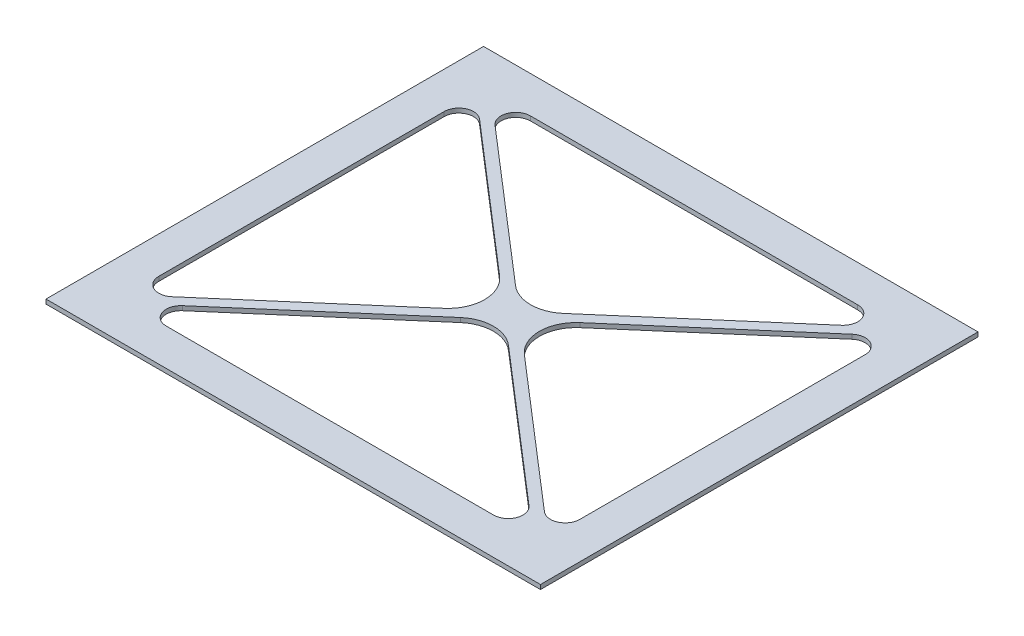
ISO-10303-21;
HEADER;
FILE_DESCRIPTION(('STEP AP214'),'2;1');
FILE_NAME('part.step','',(''),(''),'','','');
FILE_SCHEMA(('AUTOMOTIVE_DESIGN { 1 0 10303 214 1 1 1 1 }'));
ENDSEC;
DATA;
#1=APPLICATION_CONTEXT('core data for automotive mechanical design processes');
#2=APPLICATION_PROTOCOL_DEFINITION('international standard','automotive_design',2000,#1);
#3=PRODUCT_CONTEXT('',#1,'mechanical');
#4=PRODUCT('Part','Part','',(#3));
#5=PRODUCT_RELATED_PRODUCT_CATEGORY('part','',(#4));
#6=PRODUCT_DEFINITION_FORMATION('','',#4);
#7=PRODUCT_DEFINITION_CONTEXT('part definition',#1,'design');
#8=PRODUCT_DEFINITION('design','',#6,#7);
#9=PRODUCT_DEFINITION_SHAPE('','',#8);
#10=(LENGTH_UNIT() NAMED_UNIT(*) SI_UNIT(.MILLI.,.METRE.));
#11=(NAMED_UNIT(*) PLANE_ANGLE_UNIT() SI_UNIT($,.RADIAN.));
#12=(NAMED_UNIT(*) SI_UNIT($,.STERADIAN.) SOLID_ANGLE_UNIT());
#13=UNCERTAINTY_MEASURE_WITH_UNIT(LENGTH_MEASURE(1.E-05),#10,'distance_accuracy_value','');
#14=(GEOMETRIC_REPRESENTATION_CONTEXT(3) GLOBAL_UNCERTAINTY_ASSIGNED_CONTEXT((#13)) GLOBAL_UNIT_ASSIGNED_CONTEXT((#10,
#11,#12)) REPRESENTATION_CONTEXT('',''));
#15=CARTESIAN_POINT('',(0.,0.,0.));
#16=DIRECTION('',(0.,0.,1.));
#17=DIRECTION('',(1.,0.,0.));
#18=AXIS2_PLACEMENT_3D('',#15,#16,#17);
#19=CARTESIAN_POINT('',(0.,1.2,0.));
#20=DIRECTION('',(0.,-1.,0.));
#21=DIRECTION('',(0.,0.,-1.));
#22=AXIS2_PLACEMENT_3D('',#19,#20,#21);
#23=PLANE('',#22);
#24=DIRECTION('',(-0.757260981413012,0.,-0.653112399231098));
#25=VECTOR('',#24,1.);
#26=CARTESIAN_POINT('',(122.7,1.2,-10.));
#27=LINE('',#26,#25);
#28=CARTESIAN_POINT('',(114.550069440113,1.2,-17.029043925652));
#29=VERTEX_POINT('',#28);
#30=CARTESIAN_POINT('',(73.881123992311,1.2,-52.1046561486013));
#31=VERTEX_POINT('',#30);
#32=EDGE_CURVE('E432',#29,#31,#27,.T.);
#33=ORIENTED_EDGE('',*,*,#32,.F.);
#34=CARTESIAN_POINT('',(111.937619843189,1.2,-14.));
#35=DIRECTION('',(0.,-1.,0.));
#36=DIRECTION('',(0.,0.,-1.));
#37=AXIS2_PLACEMENT_3D('',#34,#35,#36);
#38=CIRCLE('',#37,4.);
#39=CARTESIAN_POINT('',(111.937619843189,1.2,-10.));
#40=VERTEX_POINT('',#39);
#41=EDGE_CURVE('E379',#29,#40,#38,.T.);
#42=ORIENTED_EDGE('',*,*,#41,.T.);
#43=DIRECTION('',(1.,0.,0.));
#44=VECTOR('',#43,1.);
#45=CARTESIAN_POINT('',(12.,1.2,-10.));
#46=LINE('',#45,#44);
#47=CARTESIAN_POINT('',(22.7623801568111,1.2,-10.));
#48=VERTEX_POINT('',#47);
#49=EDGE_CURVE('E440',#48,#40,#46,.T.);
#50=ORIENTED_EDGE('',*,*,#49,.F.);
#51=CARTESIAN_POINT('',(22.7623801568111,1.2,-14.));
#52=DIRECTION('',(0.,-1.,0.));
#53=DIRECTION('',(0.,0.,-1.));
#54=AXIS2_PLACEMENT_3D('',#51,#52,#53);
#55=CIRCLE('',#54,4.);
#56=CARTESIAN_POINT('',(20.1499305598867,1.2,-17.029043925652));
#57=VERTEX_POINT('',#56);
#58=EDGE_CURVE('E11',#48,#57,#55,.T.);
#59=ORIENTED_EDGE('',*,*,#58,.T.);
#60=DIRECTION('',(-0.757260981413012,0.,0.653112399231098));
#61=VECTOR('',#60,1.);
#62=CARTESIAN_POINT('',(12.,1.2,-10.));
#63=LINE('',#62,#61);
#64=CARTESIAN_POINT('',(60.818876007689,1.2,-52.1046561486013));
#65=VERTEX_POINT('',#64);
#66=EDGE_CURVE('E437',#65,#57,#63,.T.);
#67=ORIENTED_EDGE('',*,*,#66,.F.);
#68=CARTESIAN_POINT('',(67.35,1.2,-44.5320463344712));
#69=DIRECTION('',(0.,-1.,0.));
#70=DIRECTION('',(0.,0.,-1.));
#71=AXIS2_PLACEMENT_3D('',#68,#69,#70);
#72=CIRCLE('',#71,10.);
#73=EDGE_CURVE('E317',#65,#31,#72,.T.);
#74=ORIENTED_EDGE('',*,*,#73,.T.);
#75=EDGE_LOOP('',(#33,#42,#50,#59,#67,#74));
#76=FACE_BOUND('',#75,.T.);
#77=DIRECTION('',(0.757260981413012,0.,0.653112399231098));
#78=VECTOR('',#77,1.);
#79=CARTESIAN_POINT('',(12.,1.2,-109.2));
#80=LINE('',#79,#78);
#81=CARTESIAN_POINT('',(20.1499305598867,1.2,-102.170956074348));
#82=VERTEX_POINT('',#81);
#83=CARTESIAN_POINT('',(60.818876007689,1.2,-67.0953438513987));
#84=VERTEX_POINT('',#83);
#85=EDGE_CURVE('E477',#82,#84,#80,.T.);
#86=ORIENTED_EDGE('',*,*,#85,.F.);
#87=CARTESIAN_POINT('',(22.7623801568111,1.2,-105.2));
#88=DIRECTION('',(0.,-1.,0.));
#89=DIRECTION('',(0.,0.,-1.));
#90=AXIS2_PLACEMENT_3D('',#87,#88,#89);
#91=CIRCLE('',#90,4.);
#92=CARTESIAN_POINT('',(22.7623801568111,1.2,-109.2));
#93=VERTEX_POINT('',#92);
#94=EDGE_CURVE('E403',#82,#93,#91,.T.);
#95=ORIENTED_EDGE('',*,*,#94,.T.);
#96=DIRECTION('',(-1.,0.,0.));
#97=VECTOR('',#96,1.);
#98=CARTESIAN_POINT('',(12.,1.2,-109.2));
#99=LINE('',#98,#97);
#100=CARTESIAN_POINT('',(111.937619843189,1.2,-109.2));
#101=VERTEX_POINT('',#100);
#102=EDGE_CURVE('E485',#101,#93,#99,.T.);
#103=ORIENTED_EDGE('',*,*,#102,.F.);
#104=CARTESIAN_POINT('',(111.937619843189,1.2,-105.2));
#105=DIRECTION('',(0.,-1.,0.));
#106=DIRECTION('',(0.,0.,-1.));
#107=AXIS2_PLACEMENT_3D('',#104,#105,#106);
#108=CIRCLE('',#107,4.);
#109=CARTESIAN_POINT('',(114.550069440113,1.2,-102.170956074348));
#110=VERTEX_POINT('',#109);
#111=EDGE_CURVE('E397',#101,#110,#108,.T.);
#112=ORIENTED_EDGE('',*,*,#111,.T.);
#113=DIRECTION('',(0.757260981413012,0.,-0.653112399231098));
#114=VECTOR('',#113,1.);
#115=CARTESIAN_POINT('',(122.7,1.2,-109.2));
#116=LINE('',#115,#114);
#117=CARTESIAN_POINT('',(73.881123992311,1.2,-67.0953438513987));
#118=VERTEX_POINT('',#117);
#119=EDGE_CURVE('E480',#118,#110,#116,.T.);
#120=ORIENTED_EDGE('',*,*,#119,.F.);
#121=CARTESIAN_POINT('',(67.35,1.2,-74.6679536655288));
#122=DIRECTION('',(0.,-1.,0.));
#123=DIRECTION('',(0.,0.,-1.));
#124=AXIS2_PLACEMENT_3D('',#121,#122,#123);
#125=CIRCLE('',#124,10.);
#126=EDGE_CURVE('E303',#118,#84,#125,.T.);
#127=ORIENTED_EDGE('',*,*,#126,.T.);
#128=EDGE_LOOP('',(#86,#95,#103,#112,#120,#127));
#129=FACE_BOUND('',#128,.T.);
#130=DIRECTION('',(0.,0.,1.));
#131=VECTOR('',#130,1.);
#132=CARTESIAN_POINT('',(0.,1.2,0.));
#133=LINE('',#132,#131);
#134=CARTESIAN_POINT('',(0.,1.2,-119.2));
#135=VERTEX_POINT('',#134);
#136=CARTESIAN_POINT('',(0.,1.2,0.));
#137=VERTEX_POINT('',#136);
#138=EDGE_CURVE('E243',#135,#137,#133,.T.);
#139=ORIENTED_EDGE('',*,*,#138,.T.);
#140=DIRECTION('',(1.,0.,0.));
#141=VECTOR('',#140,1.);
#142=CARTESIAN_POINT('',(0.,1.2,0.));
#143=LINE('',#142,#141);
#144=CARTESIAN_POINT('',(134.7,1.2,0.));
#145=VERTEX_POINT('',#144);
#146=EDGE_CURVE('E231',#137,#145,#143,.T.);
#147=ORIENTED_EDGE('',*,*,#146,.T.);
#148=DIRECTION('',(0.,0.,-1.));
#149=VECTOR('',#148,1.);
#150=CARTESIAN_POINT('',(134.7,1.2,0.));
#151=LINE('',#150,#149);
#152=CARTESIAN_POINT('',(134.7,1.2,-119.2));
#153=VERTEX_POINT('',#152);
#154=EDGE_CURVE('E242',#145,#153,#151,.T.);
#155=ORIENTED_EDGE('',*,*,#154,.T.);
#156=DIRECTION('',(-1.,0.,0.));
#157=VECTOR('',#156,1.);
#158=CARTESIAN_POINT('',(0.,1.2,-119.2));
#159=LINE('',#158,#157);
#160=EDGE_CURVE('E248',#153,#135,#159,.T.);
#161=ORIENTED_EDGE('',*,*,#160,.T.);
#162=EDGE_LOOP('',(#139,#147,#155,#161));
#163=FACE_BOUND('',#162,.T.);
#164=DIRECTION('',(-0.757260981413012,0.,-0.653112399231098));
#165=VECTOR('',#164,1.);
#166=CARTESIAN_POINT('',(65.1905349794238,1.2,-59.6));
#167=LINE('',#166,#165);
#168=CARTESIAN_POINT('',(56.4103587854684,1.2,-67.1726098141301));
#169=VERTEX_POINT('',#168);
#170=CARTESIAN_POINT('',(16.6124495969244,1.2,-101.496982246486));
#171=VERTEX_POINT('',#170);
#172=EDGE_CURVE('E455',#169,#171,#167,.T.);
#173=ORIENTED_EDGE('',*,*,#172,.F.);
#174=CARTESIAN_POINT('',(49.8792347931575,1.2,-59.6));
#175=DIRECTION('',(0.,-1.,0.));
#176=DIRECTION('',(0.,0.,-1.));
#177=AXIS2_PLACEMENT_3D('',#174,#175,#176);
#178=CIRCLE('',#177,10.);
#179=CARTESIAN_POINT('',(56.4103587854684,1.2,-52.0273901858699));
#180=VERTEX_POINT('',#179);
#181=EDGE_CURVE('E296',#169,#180,#178,.T.);
#182=ORIENTED_EDGE('',*,*,#181,.T.);
#183=DIRECTION('',(0.757260981413012,0.,-0.653112399231098));
#184=VECTOR('',#183,1.);
#185=CARTESIAN_POINT('',(65.1905349794238,1.2,-59.6));
#186=LINE('',#185,#184);
#187=CARTESIAN_POINT('',(16.6124495969244,1.2,-17.7030177535143));
#188=VERTEX_POINT('',#187);
#189=EDGE_CURVE('E464',#188,#180,#186,.T.);
#190=ORIENTED_EDGE('',*,*,#189,.F.);
#191=CARTESIAN_POINT('',(14.,1.2,-20.7320616791663));
#192=DIRECTION('',(0.,-1.,0.));
#193=DIRECTION('',(0.,0.,-1.));
#194=AXIS2_PLACEMENT_3D('',#191,#192,#193);
#195=CIRCLE('',#194,4.);
#196=CARTESIAN_POINT('',(10.,1.2,-20.7320616791663));
#197=VERTEX_POINT('',#196);
#198=EDGE_CURVE('E415',#188,#197,#195,.T.);
#199=ORIENTED_EDGE('',*,*,#198,.T.);
#200=DIRECTION('',(0.,0.,1.));
#201=VECTOR('',#200,1.);
#202=CARTESIAN_POINT('',(10.,1.2,-107.2));
#203=LINE('',#202,#201);
#204=CARTESIAN_POINT('',(10.,1.2,-98.4679383208338));
#205=VERTEX_POINT('',#204);
#206=EDGE_CURVE('E459',#205,#197,#203,.T.);
#207=ORIENTED_EDGE('',*,*,#206,.F.);
#208=CARTESIAN_POINT('',(14.,1.2,-98.4679383208338));
#209=DIRECTION('',(0.,-1.,0.));
#210=DIRECTION('',(0.,0.,-1.));
#211=AXIS2_PLACEMENT_3D('',#208,#209,#210);
#212=CIRCLE('',#211,4.);
#213=EDGE_CURVE('E409',#205,#171,#212,.T.);
#214=ORIENTED_EDGE('',*,*,#213,.T.);
#215=EDGE_LOOP('',(#173,#182,#190,#199,#207,#214));
#216=FACE_BOUND('',#215,.T.);
#217=DIRECTION('',(-0.757260981413012,0.,0.653112399231098));
#218=VECTOR('',#217,1.);
#219=CARTESIAN_POINT('',(69.5094650205761,1.2,-59.6));
#220=LINE('',#219,#218);
#221=CARTESIAN_POINT('',(118.087550403076,1.2,-101.496982246486));
#222=VERTEX_POINT('',#221);
#223=CARTESIAN_POINT('',(78.2896412145316,1.2,-67.1726098141301));
#224=VERTEX_POINT('',#223);
#225=EDGE_CURVE('E602',#222,#224,#220,.T.);
#226=ORIENTED_EDGE('',*,*,#225,.F.);
#227=CARTESIAN_POINT('',(120.7,1.2,-98.4679383208337));
#228=DIRECTION('',(0.,-1.,0.));
#229=DIRECTION('',(0.,0.,-1.));
#230=AXIS2_PLACEMENT_3D('',#227,#228,#229);
#231=CIRCLE('',#230,4.);
#232=CARTESIAN_POINT('',(124.7,1.2,-98.4679383208337));
#233=VERTEX_POINT('',#232);
#234=EDGE_CURVE('E391',#222,#233,#231,.T.);
#235=ORIENTED_EDGE('',*,*,#234,.T.);
#236=DIRECTION('',(0.,0.,-1.));
#237=VECTOR('',#236,1.);
#238=CARTESIAN_POINT('',(124.7,1.2,-107.2));
#239=LINE('',#238,#237);
#240=CARTESIAN_POINT('',(124.7,1.2,-20.7320616791663));
#241=VERTEX_POINT('',#240);
#242=EDGE_CURVE('E452',#241,#233,#239,.T.);
#243=ORIENTED_EDGE('',*,*,#242,.F.);
#244=CARTESIAN_POINT('',(120.7,1.2,-20.7320616791663));
#245=DIRECTION('',(0.,-1.,0.));
#246=DIRECTION('',(0.,0.,-1.));
#247=AXIS2_PLACEMENT_3D('',#244,#245,#246);
#248=CIRCLE('',#247,4.);
#249=CARTESIAN_POINT('',(118.087550403076,1.2,-17.7030177535142));
#250=VERTEX_POINT('',#249);
#251=EDGE_CURVE('E385',#241,#250,#248,.T.);
#252=ORIENTED_EDGE('',*,*,#251,.T.);
#253=DIRECTION('',(0.757260981413012,0.,0.653112399231098));
#254=VECTOR('',#253,1.);
#255=CARTESIAN_POINT('',(69.5094650205761,1.2,-59.6));
#256=LINE('',#255,#254);
#257=CARTESIAN_POINT('',(78.2896412145316,1.2,-52.0273901858699));
#258=VERTEX_POINT('',#257);
#259=EDGE_CURVE('E612',#258,#250,#256,.T.);
#260=ORIENTED_EDGE('',*,*,#259,.F.);
#261=CARTESIAN_POINT('',(84.8207652068425,1.2,-59.6));
#262=DIRECTION('',(0.,-1.,0.));
#263=DIRECTION('',(0.,0.,-1.));
#264=AXIS2_PLACEMENT_3D('',#261,#262,#263);
#265=CIRCLE('',#264,10.);
#266=EDGE_CURVE('E310',#258,#224,#265,.T.);
#267=ORIENTED_EDGE('',*,*,#266,.T.);
#268=EDGE_LOOP('',(#226,#235,#243,#252,#260,#267));
#269=FACE_BOUND('',#268,.T.);
#270=ADVANCED_FACE('F45',(#76,#129,#163,#216,#269),#23,.F.);
#271=CARTESIAN_POINT('',(0.,0.,0.));
#272=DIRECTION('',(0.,-1.,0.));
#273=DIRECTION('',(0.,0.,-1.));
#274=AXIS2_PLACEMENT_3D('',#271,#272,#273);
#275=PLANE('',#274);
#276=DIRECTION('',(0.,0.,1.));
#277=VECTOR('',#276,1.);
#278=CARTESIAN_POINT('',(0.,0.,0.));
#279=LINE('',#278,#277);
#280=CARTESIAN_POINT('',(0.,0.,-119.2));
#281=VERTEX_POINT('',#280);
#282=CARTESIAN_POINT('',(0.,0.,0.));
#283=VERTEX_POINT('',#282);
#284=EDGE_CURVE('E257',#281,#283,#279,.T.);
#285=ORIENTED_EDGE('',*,*,#284,.F.);
#286=DIRECTION('',(-1.,0.,0.));
#287=VECTOR('',#286,1.);
#288=CARTESIAN_POINT('',(0.,0.,-119.2));
#289=LINE('',#288,#287);
#290=CARTESIAN_POINT('',(134.7,0.,-119.2));
#291=VERTEX_POINT('',#290);
#292=EDGE_CURVE('E253',#291,#281,#289,.T.);
#293=ORIENTED_EDGE('',*,*,#292,.F.);
#294=DIRECTION('',(0.,0.,-1.));
#295=VECTOR('',#294,1.);
#296=CARTESIAN_POINT('',(134.7,0.,0.));
#297=LINE('',#296,#295);
#298=CARTESIAN_POINT('',(134.7,0.,0.));
#299=VERTEX_POINT('',#298);
#300=EDGE_CURVE('E508',#299,#291,#297,.T.);
#301=ORIENTED_EDGE('',*,*,#300,.F.);
#302=DIRECTION('',(1.,0.,0.));
#303=VECTOR('',#302,1.);
#304=CARTESIAN_POINT('',(0.,0.,0.));
#305=LINE('',#304,#303);
#306=EDGE_CURVE('E505',#283,#299,#305,.T.);
#307=ORIENTED_EDGE('',*,*,#306,.F.);
#308=EDGE_LOOP('',(#285,#293,#301,#307));
#309=FACE_BOUND('',#308,.T.);
#310=DIRECTION('',(0.757260981413012,0.,-0.653112399231098));
#311=VECTOR('',#310,1.);
#312=CARTESIAN_POINT('',(122.7,0.,-109.2));
#313=LINE('',#312,#311);
#314=CARTESIAN_POINT('',(73.881123992311,0.,-67.0953438513987));
#315=VERTEX_POINT('',#314);
#316=CARTESIAN_POINT('',(114.550069440113,0.,-102.170956074348));
#317=VERTEX_POINT('',#316);
#318=EDGE_CURVE('E491',#315,#317,#313,.T.);
#319=ORIENTED_EDGE('',*,*,#318,.T.);
#320=CARTESIAN_POINT('',(111.937619843189,0.,-105.2));
#321=DIRECTION('',(0.,-1.,0.));
#322=DIRECTION('',(0.,0.,-1.));
#323=AXIS2_PLACEMENT_3D('',#320,#321,#322);
#324=CIRCLE('',#323,4.);
#325=CARTESIAN_POINT('',(111.937619843189,0.,-109.2));
#326=VERTEX_POINT('',#325);
#327=EDGE_CURVE('E394',#317,#326,#324,.F.);
#328=ORIENTED_EDGE('',*,*,#327,.T.);
#329=DIRECTION('',(-1.,0.,0.));
#330=VECTOR('',#329,1.);
#331=CARTESIAN_POINT('',(12.,0.,-109.2));
#332=LINE('',#331,#330);
#333=CARTESIAN_POINT('',(22.7623801568111,0.,-109.2));
#334=VERTEX_POINT('',#333);
#335=EDGE_CURVE('E481',#326,#334,#332,.T.);
#336=ORIENTED_EDGE('',*,*,#335,.T.);
#337=CARTESIAN_POINT('',(22.7623801568111,0.,-105.2));
#338=DIRECTION('',(0.,-1.,0.));
#339=DIRECTION('',(0.,0.,-1.));
#340=AXIS2_PLACEMENT_3D('',#337,#338,#339);
#341=CIRCLE('',#340,4.);
#342=CARTESIAN_POINT('',(20.1499305598867,0.,-102.170956074348));
#343=VERTEX_POINT('',#342);
#344=EDGE_CURVE('E400',#334,#343,#341,.F.);
#345=ORIENTED_EDGE('',*,*,#344,.T.);
#346=DIRECTION('',(0.757260981413012,0.,0.653112399231098));
#347=VECTOR('',#346,1.);
#348=CARTESIAN_POINT('',(12.,0.,-109.2));
#349=LINE('',#348,#347);
#350=CARTESIAN_POINT('',(60.818876007689,0.,-67.0953438513987));
#351=VERTEX_POINT('',#350);
#352=EDGE_CURVE('E467',#343,#351,#349,.T.);
#353=ORIENTED_EDGE('',*,*,#352,.T.);
#354=CARTESIAN_POINT('',(67.35,0.,-74.6679536655288));
#355=DIRECTION('',(0.,-1.,0.));
#356=DIRECTION('',(0.,0.,-1.));
#357=AXIS2_PLACEMENT_3D('',#354,#355,#356);
#358=CIRCLE('',#357,10.);
#359=EDGE_CURVE('E300',#351,#315,#358,.F.);
#360=ORIENTED_EDGE('',*,*,#359,.T.);
#361=EDGE_LOOP('',(#319,#328,#336,#345,#353,#360));
#362=FACE_BOUND('',#361,.T.);
#363=DIRECTION('',(0.,0.,1.));
#364=VECTOR('',#363,1.);
#365=CARTESIAN_POINT('',(10.,0.,-107.2));
#366=LINE('',#365,#364);
#367=CARTESIAN_POINT('',(10.,0.,-98.4679383208338));
#368=VERTEX_POINT('',#367);
#369=CARTESIAN_POINT('',(10.,0.,-20.7320616791663));
#370=VERTEX_POINT('',#369);
#371=EDGE_CURVE('E471',#368,#370,#366,.T.);
#372=ORIENTED_EDGE('',*,*,#371,.T.);
#373=CARTESIAN_POINT('',(14.,0.,-20.7320616791663));
#374=DIRECTION('',(0.,-1.,0.));
#375=DIRECTION('',(0.,0.,-1.));
#376=AXIS2_PLACEMENT_3D('',#373,#374,#375);
#377=CIRCLE('',#376,4.);
#378=CARTESIAN_POINT('',(16.6124495969244,0.,-17.7030177535143));
#379=VERTEX_POINT('',#378);
#380=EDGE_CURVE('E412',#370,#379,#377,.F.);
#381=ORIENTED_EDGE('',*,*,#380,.T.);
#382=DIRECTION('',(0.757260981413012,0.,-0.653112399231098));
#383=VECTOR('',#382,1.);
#384=CARTESIAN_POINT('',(65.1905349794238,0.,-59.6));
#385=LINE('',#384,#383);
#386=CARTESIAN_POINT('',(56.4103587854684,0.,-52.0273901858699));
#387=VERTEX_POINT('',#386);
#388=EDGE_CURVE('E460',#379,#387,#385,.T.);
#389=ORIENTED_EDGE('',*,*,#388,.T.);
#390=CARTESIAN_POINT('',(49.8792347931575,0.,-59.6));
#391=DIRECTION('',(0.,-1.,0.));
#392=DIRECTION('',(0.,0.,-1.));
#393=AXIS2_PLACEMENT_3D('',#390,#391,#392);
#394=CIRCLE('',#393,10.);
#395=CARTESIAN_POINT('',(56.4103587854684,0.,-67.1726098141301));
#396=VERTEX_POINT('',#395);
#397=EDGE_CURVE('E293',#387,#396,#394,.F.);
#398=ORIENTED_EDGE('',*,*,#397,.T.);
#399=DIRECTION('',(-0.757260981413012,0.,-0.653112399231098));
#400=VECTOR('',#399,1.);
#401=CARTESIAN_POINT('',(65.1905349794238,0.,-59.6));
#402=LINE('',#401,#400);
#403=CARTESIAN_POINT('',(16.6124495969244,0.,-101.496982246486));
#404=VERTEX_POINT('',#403);
#405=EDGE_CURVE('E444',#396,#404,#402,.T.);
#406=ORIENTED_EDGE('',*,*,#405,.T.);
#407=CARTESIAN_POINT('',(14.,0.,-98.4679383208338));
#408=DIRECTION('',(0.,-1.,0.));
#409=DIRECTION('',(0.,0.,-1.));
#410=AXIS2_PLACEMENT_3D('',#407,#408,#409);
#411=CIRCLE('',#410,4.);
#412=EDGE_CURVE('E406',#404,#368,#411,.F.);
#413=ORIENTED_EDGE('',*,*,#412,.T.);
#414=EDGE_LOOP('',(#372,#381,#389,#398,#406,#413));
#415=FACE_BOUND('',#414,.T.);
#416=DIRECTION('',(-0.757260981413012,0.,0.653112399231098));
#417=VECTOR('',#416,1.);
#418=CARTESIAN_POINT('',(12.,0.,-10.));
#419=LINE('',#418,#417);
#420=CARTESIAN_POINT('',(60.818876007689,0.,-52.1046561486013));
#421=VERTEX_POINT('',#420);
#422=CARTESIAN_POINT('',(20.1499305598867,0.,-17.029043925652));
#423=VERTEX_POINT('',#422);
#424=EDGE_CURVE('E426',#421,#423,#419,.T.);
#425=ORIENTED_EDGE('',*,*,#424,.T.);
#426=CARTESIAN_POINT('',(22.7623801568111,0.,-14.));
#427=DIRECTION('',(0.,-1.,0.));
#428=DIRECTION('',(0.,0.,-1.));
#429=AXIS2_PLACEMENT_3D('',#426,#427,#428);
#430=CIRCLE('',#429,4.);
#431=CARTESIAN_POINT('',(22.7623801568111,0.,-10.));
#432=VERTEX_POINT('',#431);
#433=EDGE_CURVE('E54',#423,#432,#430,.F.);
#434=ORIENTED_EDGE('',*,*,#433,.T.);
#435=DIRECTION('',(1.,0.,0.));
#436=VECTOR('',#435,1.);
#437=CARTESIAN_POINT('',(12.,0.,-10.));
#438=LINE('',#437,#436);
#439=CARTESIAN_POINT('',(111.937619843189,0.,-10.));
#440=VERTEX_POINT('',#439);
#441=EDGE_CURVE('E424',#432,#440,#438,.T.);
#442=ORIENTED_EDGE('',*,*,#441,.T.);
#443=CARTESIAN_POINT('',(111.937619843189,0.,-14.));
#444=DIRECTION('',(0.,-1.,0.));
#445=DIRECTION('',(0.,0.,-1.));
#446=AXIS2_PLACEMENT_3D('',#443,#444,#445);
#447=CIRCLE('',#446,4.);
#448=CARTESIAN_POINT('',(114.550069440113,0.,-17.029043925652));
#449=VERTEX_POINT('',#448);
#450=EDGE_CURVE('E376',#440,#449,#447,.F.);
#451=ORIENTED_EDGE('',*,*,#450,.T.);
#452=DIRECTION('',(-0.757260981413012,0.,-0.653112399231098));
#453=VECTOR('',#452,1.);
#454=CARTESIAN_POINT('',(122.7,0.,-10.));
#455=LINE('',#454,#453);
#456=CARTESIAN_POINT('',(73.881123992311,0.,-52.1046561486013));
#457=VERTEX_POINT('',#456);
#458=EDGE_CURVE('E449',#449,#457,#455,.T.);
#459=ORIENTED_EDGE('',*,*,#458,.T.);
#460=CARTESIAN_POINT('',(67.35,0.,-44.5320463344712));
#461=DIRECTION('',(0.,-1.,0.));
#462=DIRECTION('',(0.,0.,-1.));
#463=AXIS2_PLACEMENT_3D('',#460,#461,#462);
#464=CIRCLE('',#463,10.);
#465=EDGE_CURVE('E314',#457,#421,#464,.F.);
#466=ORIENTED_EDGE('',*,*,#465,.T.);
#467=EDGE_LOOP('',(#425,#434,#442,#451,#459,#466));
#468=FACE_BOUND('',#467,.T.);
#469=DIRECTION('',(0.757260981413012,0.,0.653112399231098));
#470=VECTOR('',#469,1.);
#471=CARTESIAN_POINT('',(69.5094650205761,0.,-59.6));
#472=LINE('',#471,#470);
#473=CARTESIAN_POINT('',(78.2896412145316,0.,-52.0273901858699));
#474=VERTEX_POINT('',#473);
#475=CARTESIAN_POINT('',(118.087550403076,0.,-17.7030177535142));
#476=VERTEX_POINT('',#475);
#477=EDGE_CURVE('E603',#474,#476,#472,.T.);
#478=ORIENTED_EDGE('',*,*,#477,.T.);
#479=CARTESIAN_POINT('',(120.7,0.,-20.7320616791663));
#480=DIRECTION('',(0.,-1.,0.));
#481=DIRECTION('',(0.,0.,-1.));
#482=AXIS2_PLACEMENT_3D('',#479,#480,#481);
#483=CIRCLE('',#482,4.);
#484=CARTESIAN_POINT('',(124.7,0.,-20.7320616791663));
#485=VERTEX_POINT('',#484);
#486=EDGE_CURVE('E382',#476,#485,#483,.F.);
#487=ORIENTED_EDGE('',*,*,#486,.T.);
#488=DIRECTION('',(0.,0.,-1.));
#489=VECTOR('',#488,1.);
#490=CARTESIAN_POINT('',(124.7,0.,-107.2));
#491=LINE('',#490,#489);
#492=CARTESIAN_POINT('',(124.7,0.,-98.4679383208337));
#493=VERTEX_POINT('',#492);
#494=EDGE_CURVE('E596',#485,#493,#491,.T.);
#495=ORIENTED_EDGE('',*,*,#494,.T.);
#496=CARTESIAN_POINT('',(120.7,0.,-98.4679383208337));
#497=DIRECTION('',(0.,-1.,0.));
#498=DIRECTION('',(0.,0.,-1.));
#499=AXIS2_PLACEMENT_3D('',#496,#497,#498);
#500=CIRCLE('',#499,4.);
#501=CARTESIAN_POINT('',(118.087550403076,0.,-101.496982246486));
#502=VERTEX_POINT('',#501);
#503=EDGE_CURVE('E388',#493,#502,#500,.F.);
#504=ORIENTED_EDGE('',*,*,#503,.T.);
#505=DIRECTION('',(-0.757260981413012,0.,0.653112399231098));
#506=VECTOR('',#505,1.);
#507=CARTESIAN_POINT('',(69.5094650205761,0.,-59.6));
#508=LINE('',#507,#506);
#509=CARTESIAN_POINT('',(78.2896412145316,0.,-67.1726098141301));
#510=VERTEX_POINT('',#509);
#511=EDGE_CURVE('E624',#502,#510,#508,.T.);
#512=ORIENTED_EDGE('',*,*,#511,.T.);
#513=CARTESIAN_POINT('',(84.8207652068425,0.,-59.6));
#514=DIRECTION('',(0.,-1.,0.));
#515=DIRECTION('',(0.,0.,-1.));
#516=AXIS2_PLACEMENT_3D('',#513,#514,#515);
#517=CIRCLE('',#516,10.);
#518=EDGE_CURVE('E307',#510,#474,#517,.F.);
#519=ORIENTED_EDGE('',*,*,#518,.T.);
#520=EDGE_LOOP('',(#478,#487,#495,#504,#512,#519));
#521=FACE_BOUND('',#520,.T.);
#522=ADVANCED_FACE('F422',(#309,#362,#415,#468,#521),#275,.T.);
#523=CARTESIAN_POINT('',(0.,1.2,0.));
#524=DIRECTION('',(1.,0.,0.));
#525=DIRECTION('',(0.,0.,-1.));
#526=AXIS2_PLACEMENT_3D('',#523,#524,#525);
#527=PLANE('',#526);
#528=ORIENTED_EDGE('',*,*,#284,.T.);
#529=DIRECTION('',(0.,-1.,0.));
#530=VECTOR('',#529,1.);
#531=CARTESIAN_POINT('',(0.,1.2,0.));
#532=LINE('',#531,#530);
#533=EDGE_CURVE('E235',#137,#283,#532,.T.);
#534=ORIENTED_EDGE('',*,*,#533,.F.);
#535=ORIENTED_EDGE('',*,*,#138,.F.);
#536=DIRECTION('',(0.,-1.,0.));
#537=VECTOR('',#536,1.);
#538=CARTESIAN_POINT('',(0.,1.2,-119.2));
#539=LINE('',#538,#537);
#540=EDGE_CURVE('E502',#135,#281,#539,.T.);
#541=ORIENTED_EDGE('',*,*,#540,.T.);
#542=EDGE_LOOP('',(#528,#534,#535,#541));
#543=FACE_BOUND('',#542,.T.);
#544=ADVANCED_FACE('F255',(#543),#527,.F.);
#545=CARTESIAN_POINT('',(0.,1.2,0.));
#546=DIRECTION('',(0.,0.,-1.));
#547=DIRECTION('',(-1.,0.,0.));
#548=AXIS2_PLACEMENT_3D('',#545,#546,#547);
#549=PLANE('',#548);
#550=ORIENTED_EDGE('',*,*,#306,.T.);
#551=DIRECTION('',(0.,-1.,0.));
#552=VECTOR('',#551,1.);
#553=CARTESIAN_POINT('',(134.7,1.2,0.));
#554=LINE('',#553,#552);
#555=EDGE_CURVE('E238',#145,#299,#554,.T.);
#556=ORIENTED_EDGE('',*,*,#555,.F.);
#557=ORIENTED_EDGE('',*,*,#146,.F.);
#558=ORIENTED_EDGE('',*,*,#533,.T.);
#559=EDGE_LOOP('',(#550,#556,#557,#558));
#560=FACE_BOUND('',#559,.T.);
#561=ADVANCED_FACE('F233',(#560),#549,.F.);
#562=CARTESIAN_POINT('',(134.7,1.2,0.));
#563=DIRECTION('',(-1.,0.,0.));
#564=DIRECTION('',(0.,0.,1.));
#565=AXIS2_PLACEMENT_3D('',#562,#563,#564);
#566=PLANE('',#565);
#567=ORIENTED_EDGE('',*,*,#300,.T.);
#568=DIRECTION('',(0.,-1.,0.));
#569=VECTOR('',#568,1.);
#570=CARTESIAN_POINT('',(134.7,1.2,-119.2));
#571=LINE('',#570,#569);
#572=EDGE_CURVE('E266',#153,#291,#571,.T.);
#573=ORIENTED_EDGE('',*,*,#572,.F.);
#574=ORIENTED_EDGE('',*,*,#154,.F.);
#575=ORIENTED_EDGE('',*,*,#555,.T.);
#576=EDGE_LOOP('',(#567,#573,#574,#575));
#577=FACE_BOUND('',#576,.T.);
#578=ADVANCED_FACE('F524',(#577),#566,.F.);
#579=CARTESIAN_POINT('',(0.,1.2,-119.2));
#580=DIRECTION('',(0.,0.,1.));
#581=DIRECTION('',(1.,0.,0.));
#582=AXIS2_PLACEMENT_3D('',#579,#580,#581);
#583=PLANE('',#582);
#584=ORIENTED_EDGE('',*,*,#292,.T.);
#585=ORIENTED_EDGE('',*,*,#540,.F.);
#586=ORIENTED_EDGE('',*,*,#160,.F.);
#587=ORIENTED_EDGE('',*,*,#572,.T.);
#588=EDGE_LOOP('',(#584,#585,#586,#587));
#589=FACE_BOUND('',#588,.T.);
#590=ADVANCED_FACE('F519',(#589),#583,.F.);
#591=CARTESIAN_POINT('',(12.,1.2,-109.2));
#592=DIRECTION('',(0.653112399231098,0.,-0.757260981413012));
#593=DIRECTION('',(-0.757260981413012,0.,-0.653112399231098));
#594=AXIS2_PLACEMENT_3D('',#591,#592,#593);
#595=PLANE('',#594);
#596=ORIENTED_EDGE('',*,*,#352,.F.);
#597=DIRECTION('',(0.,-1.,0.));
#598=VECTOR('',#597,1.);
#599=CARTESIAN_POINT('',(20.1499305598867,1.2,-102.170956074348));
#600=LINE('',#599,#598);
#601=EDGE_CURVE('E356',#343,#82,#600,.F.);
#602=ORIENTED_EDGE('',*,*,#601,.T.);
#603=ORIENTED_EDGE('',*,*,#85,.T.);
#604=DIRECTION('',(0.,-1.,0.));
#605=VECTOR('',#604,1.);
#606=CARTESIAN_POINT('',(60.818876007689,0.,-67.0953438513987));
#607=LINE('',#606,#605);
#608=EDGE_CURVE('E272',#84,#351,#607,.T.);
#609=ORIENTED_EDGE('',*,*,#608,.T.);
#610=EDGE_LOOP('',(#596,#602,#603,#609));
#611=FACE_BOUND('',#610,.T.);
#612=ADVANCED_FACE('F531',(#611),#595,.T.);
#613=CARTESIAN_POINT('',(122.7,1.2,-109.2));
#614=DIRECTION('',(-0.653112399231098,0.,-0.757260981413012));
#615=DIRECTION('',(-0.757260981413012,0.,0.653112399231098));
#616=AXIS2_PLACEMENT_3D('',#613,#614,#615);
#617=PLANE('',#616);
#618=ORIENTED_EDGE('',*,*,#119,.T.);
#619=DIRECTION('',(0.,-1.,0.));
#620=VECTOR('',#619,1.);
#621=CARTESIAN_POINT('',(114.550069440113,0.,-102.170956074348));
#622=LINE('',#621,#620);
#623=EDGE_CURVE('E345',#110,#317,#622,.T.);
#624=ORIENTED_EDGE('',*,*,#623,.T.);
#625=ORIENTED_EDGE('',*,*,#318,.F.);
#626=DIRECTION('',(0.,-1.,0.));
#627=VECTOR('',#626,1.);
#628=CARTESIAN_POINT('',(73.881123992311,1.2,-67.0953438513987));
#629=LINE('',#628,#627);
#630=EDGE_CURVE('E276',#315,#118,#629,.F.);
#631=ORIENTED_EDGE('',*,*,#630,.T.);
#632=EDGE_LOOP('',(#618,#624,#625,#631));
#633=FACE_BOUND('',#632,.T.);
#634=ADVANCED_FACE('F546',(#633),#617,.T.);
#635=CARTESIAN_POINT('',(12.,1.2,-109.2));
#636=DIRECTION('',(0.,0.,1.));
#637=DIRECTION('',(1.,0.,0.));
#638=AXIS2_PLACEMENT_3D('',#635,#636,#637);
#639=PLANE('',#638);
#640=ORIENTED_EDGE('',*,*,#335,.F.);
#641=DIRECTION('',(0.,-1.,0.));
#642=VECTOR('',#641,1.);
#643=CARTESIAN_POINT('',(111.937619843189,1.2,-109.2));
#644=LINE('',#643,#642);
#645=EDGE_CURVE('E353',#326,#101,#644,.F.);
#646=ORIENTED_EDGE('',*,*,#645,.T.);
#647=ORIENTED_EDGE('',*,*,#102,.T.);
#648=DIRECTION('',(0.,-1.,0.));
#649=VECTOR('',#648,1.);
#650=CARTESIAN_POINT('',(22.7623801568111,0.,-109.2));
#651=LINE('',#650,#649);
#652=EDGE_CURVE('E349',#93,#334,#651,.T.);
#653=ORIENTED_EDGE('',*,*,#652,.T.);
#654=EDGE_LOOP('',(#640,#646,#647,#653));
#655=FACE_BOUND('',#654,.T.);
#656=ADVANCED_FACE('F550',(#655),#639,.T.);
#657=CARTESIAN_POINT('',(65.1905349794238,1.2,-59.6));
#658=DIRECTION('',(-0.653112399231099,0.,0.757260981413012));
#659=DIRECTION('',(0.757260981413012,0.,0.653112399231099));
#660=AXIS2_PLACEMENT_3D('',#657,#658,#659);
#661=PLANE('',#660);
#662=ORIENTED_EDGE('',*,*,#172,.T.);
#663=DIRECTION('',(0.,-1.,0.));
#664=VECTOR('',#663,1.);
#665=CARTESIAN_POINT('',(16.6124495969244,0.,-101.496982246486));
#666=LINE('',#665,#664);
#667=EDGE_CURVE('E359',#171,#404,#666,.T.);
#668=ORIENTED_EDGE('',*,*,#667,.T.);
#669=ORIENTED_EDGE('',*,*,#405,.F.);
#670=DIRECTION('',(0.,-1.,0.));
#671=VECTOR('',#670,1.);
#672=CARTESIAN_POINT('',(56.4103587854684,1.2,-67.1726098141301));
#673=LINE('',#672,#671);
#674=EDGE_CURVE('E264',#396,#169,#673,.F.);
#675=ORIENTED_EDGE('',*,*,#674,.T.);
#676=EDGE_LOOP('',(#662,#668,#669,#675));
#677=FACE_BOUND('',#676,.T.);
#678=ADVANCED_FACE('F554',(#677),#661,.T.);
#679=CARTESIAN_POINT('',(10.,1.2,-107.2));
#680=DIRECTION('',(1.,0.,0.));
#681=DIRECTION('',(0.,0.,-1.));
#682=AXIS2_PLACEMENT_3D('',#679,#680,#681);
#683=PLANE('',#682);
#684=ORIENTED_EDGE('',*,*,#371,.F.);
#685=DIRECTION('',(0.,-1.,0.));
#686=VECTOR('',#685,1.);
#687=CARTESIAN_POINT('',(10.,1.2,-98.4679383208338));
#688=LINE('',#687,#686);
#689=EDGE_CURVE('E367',#368,#205,#688,.F.);
#690=ORIENTED_EDGE('',*,*,#689,.T.);
#691=ORIENTED_EDGE('',*,*,#206,.T.);
#692=DIRECTION('',(0.,-1.,0.));
#693=VECTOR('',#692,1.);
#694=CARTESIAN_POINT('',(10.,0.,-20.7320616791663));
#695=LINE('',#694,#693);
#696=EDGE_CURVE('E363',#197,#370,#695,.T.);
#697=ORIENTED_EDGE('',*,*,#696,.T.);
#698=EDGE_LOOP('',(#684,#690,#691,#697));
#699=FACE_BOUND('',#698,.T.);
#700=ADVANCED_FACE('F558',(#699),#683,.T.);
#701=CARTESIAN_POINT('',(65.1905349794238,1.2,-59.6));
#702=DIRECTION('',(-0.653112399231098,0.,-0.757260981413012));
#703=DIRECTION('',(-0.757260981413012,0.,0.653112399231098));
#704=AXIS2_PLACEMENT_3D('',#701,#702,#703);
#705=PLANE('',#704);
#706=ORIENTED_EDGE('',*,*,#388,.F.);
#707=DIRECTION('',(0.,-1.,0.));
#708=VECTOR('',#707,1.);
#709=CARTESIAN_POINT('',(16.6124495969244,1.2,-17.7030177535142));
#710=LINE('',#709,#708);
#711=EDGE_CURVE('E370',#379,#188,#710,.F.);
#712=ORIENTED_EDGE('',*,*,#711,.T.);
#713=ORIENTED_EDGE('',*,*,#189,.T.);
#714=DIRECTION('',(0.,-1.,0.));
#715=VECTOR('',#714,1.);
#716=CARTESIAN_POINT('',(56.4103587854684,0.,-52.0273901858699));
#717=LINE('',#716,#715);
#718=EDGE_CURVE('E259',#180,#387,#717,.T.);
#719=ORIENTED_EDGE('',*,*,#718,.T.);
#720=EDGE_LOOP('',(#706,#712,#713,#719));
#721=FACE_BOUND('',#720,.T.);
#722=ADVANCED_FACE('F562',(#721),#705,.T.);
#723=CARTESIAN_POINT('',(122.7,1.2,-10.));
#724=DIRECTION('',(-0.653112399231098,0.,0.757260981413012));
#725=DIRECTION('',(0.757260981413012,0.,0.653112399231098));
#726=AXIS2_PLACEMENT_3D('',#723,#724,#725);
#727=PLANE('',#726);
#728=ORIENTED_EDGE('',*,*,#458,.F.);
#729=DIRECTION('',(0.,-1.,0.));
#730=VECTOR('',#729,1.);
#731=CARTESIAN_POINT('',(114.550069440113,1.2,-17.029043925652));
#732=LINE('',#731,#730);
#733=EDGE_CURVE('E328',#449,#29,#732,.F.);
#734=ORIENTED_EDGE('',*,*,#733,.T.);
#735=ORIENTED_EDGE('',*,*,#32,.T.);
#736=DIRECTION('',(0.,-1.,0.));
#737=VECTOR('',#736,1.);
#738=CARTESIAN_POINT('',(73.881123992311,0.,-52.1046561486013));
#739=LINE('',#738,#737);
#740=EDGE_CURVE('E286',#31,#457,#739,.T.);
#741=ORIENTED_EDGE('',*,*,#740,.T.);
#742=EDGE_LOOP('',(#728,#734,#735,#741));
#743=FACE_BOUND('',#742,.T.);
#744=ADVANCED_FACE('F566',(#743),#727,.T.);
#745=CARTESIAN_POINT('',(12.,1.2,-10.));
#746=DIRECTION('',(0.653112399231098,0.,0.757260981413012));
#747=DIRECTION('',(0.757260981413012,0.,-0.653112399231098));
#748=AXIS2_PLACEMENT_3D('',#745,#746,#747);
#749=PLANE('',#748);
#750=ORIENTED_EDGE('',*,*,#66,.T.);
#751=DIRECTION('',(0.,-1.,0.));
#752=VECTOR('',#751,1.);
#753=CARTESIAN_POINT('',(20.1499305598867,0.,-17.029043925652));
#754=LINE('',#753,#752);
#755=EDGE_CURVE('E373',#57,#423,#754,.T.);
#756=ORIENTED_EDGE('',*,*,#755,.T.);
#757=ORIENTED_EDGE('',*,*,#424,.F.);
#758=DIRECTION('',(0.,-1.,0.));
#759=VECTOR('',#758,1.);
#760=CARTESIAN_POINT('',(60.818876007689,1.2,-52.1046561486013));
#761=LINE('',#760,#759);
#762=EDGE_CURVE('E290',#421,#65,#761,.F.);
#763=ORIENTED_EDGE('',*,*,#762,.T.);
#764=EDGE_LOOP('',(#750,#756,#757,#763));
#765=FACE_BOUND('',#764,.T.);
#766=ADVANCED_FACE('F435',(#765),#749,.T.);
#767=CARTESIAN_POINT('',(12.,1.2,-10.));
#768=DIRECTION('',(0.,0.,-1.));
#769=DIRECTION('',(-1.,0.,0.));
#770=AXIS2_PLACEMENT_3D('',#767,#768,#769);
#771=PLANE('',#770);
#772=ORIENTED_EDGE('',*,*,#49,.T.);
#773=DIRECTION('',(0.,-1.,0.));
#774=VECTOR('',#773,1.);
#775=CARTESIAN_POINT('',(111.937619843189,0.,-10.));
#776=LINE('',#775,#774);
#777=EDGE_CURVE('E324',#40,#440,#776,.T.);
#778=ORIENTED_EDGE('',*,*,#777,.T.);
#779=ORIENTED_EDGE('',*,*,#441,.F.);
#780=DIRECTION('',(0.,-1.,0.));
#781=VECTOR('',#780,1.);
#782=CARTESIAN_POINT('',(22.7623801568111,1.2,-10.));
#783=LINE('',#782,#781);
#784=EDGE_CURVE('E321',#432,#48,#783,.F.);
#785=ORIENTED_EDGE('',*,*,#784,.T.);
#786=EDGE_LOOP('',(#772,#778,#779,#785));
#787=FACE_BOUND('',#786,.T.);
#788=ADVANCED_FACE('F429',(#787),#771,.T.);
#789=CARTESIAN_POINT('',(69.5094650205761,1.2,-59.6));
#790=DIRECTION('',(0.653112399231098,0.,0.757260981413012));
#791=DIRECTION('',(0.757260981413012,0.,-0.653112399231098));
#792=AXIS2_PLACEMENT_3D('',#789,#790,#791);
#793=PLANE('',#792);
#794=ORIENTED_EDGE('',*,*,#511,.F.);
#795=DIRECTION('',(0.,-1.,0.));
#796=VECTOR('',#795,1.);
#797=CARTESIAN_POINT('',(118.087550403076,1.2,-101.496982246486));
#798=LINE('',#797,#796);
#799=EDGE_CURVE('E342',#502,#222,#798,.F.);
#800=ORIENTED_EDGE('',*,*,#799,.T.);
#801=ORIENTED_EDGE('',*,*,#225,.T.);
#802=DIRECTION('',(0.,-1.,0.));
#803=VECTOR('',#802,1.);
#804=CARTESIAN_POINT('',(78.2896412145316,0.,-67.1726098141301));
#805=LINE('',#804,#803);
#806=EDGE_CURVE('E279',#224,#510,#805,.T.);
#807=ORIENTED_EDGE('',*,*,#806,.T.);
#808=EDGE_LOOP('',(#794,#800,#801,#807));
#809=FACE_BOUND('',#808,.T.);
#810=ADVANCED_FACE('F575',(#809),#793,.T.);
#811=CARTESIAN_POINT('',(69.5094650205761,1.2,-59.6));
#812=DIRECTION('',(0.653112399231098,0.,-0.757260981413012));
#813=DIRECTION('',(-0.757260981413012,0.,-0.653112399231098));
#814=AXIS2_PLACEMENT_3D('',#811,#812,#813);
#815=PLANE('',#814);
#816=ORIENTED_EDGE('',*,*,#259,.T.);
#817=DIRECTION('',(0.,-1.,0.));
#818=VECTOR('',#817,1.);
#819=CARTESIAN_POINT('',(118.087550403076,0.,-17.7030177535142));
#820=LINE('',#819,#818);
#821=EDGE_CURVE('E331',#250,#476,#820,.T.);
#822=ORIENTED_EDGE('',*,*,#821,.T.);
#823=ORIENTED_EDGE('',*,*,#477,.F.);
#824=DIRECTION('',(0.,-1.,0.));
#825=VECTOR('',#824,1.);
#826=CARTESIAN_POINT('',(78.2896412145316,1.2,-52.0273901858699));
#827=LINE('',#826,#825);
#828=EDGE_CURVE('E283',#474,#258,#827,.F.);
#829=ORIENTED_EDGE('',*,*,#828,.T.);
#830=EDGE_LOOP('',(#816,#822,#823,#829));
#831=FACE_BOUND('',#830,.T.);
#832=ADVANCED_FACE('F578',(#831),#815,.T.);
#833=CARTESIAN_POINT('',(124.7,1.2,-107.2));
#834=DIRECTION('',(-1.,0.,0.));
#835=DIRECTION('',(0.,0.,1.));
#836=AXIS2_PLACEMENT_3D('',#833,#834,#835);
#837=PLANE('',#836);
#838=ORIENTED_EDGE('',*,*,#494,.F.);
#839=DIRECTION('',(0.,-1.,0.));
#840=VECTOR('',#839,1.);
#841=CARTESIAN_POINT('',(124.7,1.2,-20.7320616791663));
#842=LINE('',#841,#840);
#843=EDGE_CURVE('E339',#485,#241,#842,.F.);
#844=ORIENTED_EDGE('',*,*,#843,.T.);
#845=ORIENTED_EDGE('',*,*,#242,.T.);
#846=DIRECTION('',(0.,-1.,0.));
#847=VECTOR('',#846,1.);
#848=CARTESIAN_POINT('',(124.7,0.,-98.4679383208337));
#849=LINE('',#848,#847);
#850=EDGE_CURVE('E335',#233,#493,#849,.T.);
#851=ORIENTED_EDGE('',*,*,#850,.T.);
#852=EDGE_LOOP('',(#838,#844,#845,#851));
#853=FACE_BOUND('',#852,.T.);
#854=ADVANCED_FACE('F582',(#853),#837,.T.);
#855=CARTESIAN_POINT('',(49.8792347931575,1.2,-59.6));
#856=DIRECTION('',(0.,1.,0.));
#857=DIRECTION('',(0.,0.,1.));
#858=AXIS2_PLACEMENT_3D('',#855,#856,#857);
#859=CYLINDRICAL_SURFACE('',#858,10.);
#860=ORIENTED_EDGE('',*,*,#181,.F.);
#861=ORIENTED_EDGE('',*,*,#674,.F.);
#862=ORIENTED_EDGE('',*,*,#397,.F.);
#863=ORIENTED_EDGE('',*,*,#718,.F.);
#864=EDGE_LOOP('',(#860,#861,#862,#863));
#865=FACE_BOUND('',#864,.T.);
#866=ADVANCED_FACE('F585',(#865),#859,.F.);
#867=CARTESIAN_POINT('',(67.35,1.2,-74.6679536655288));
#868=DIRECTION('',(0.,1.,0.));
#869=DIRECTION('',(0.,0.,1.));
#870=AXIS2_PLACEMENT_3D('',#867,#868,#869);
#871=CYLINDRICAL_SURFACE('',#870,10.);
#872=ORIENTED_EDGE('',*,*,#126,.F.);
#873=ORIENTED_EDGE('',*,*,#630,.F.);
#874=ORIENTED_EDGE('',*,*,#359,.F.);
#875=ORIENTED_EDGE('',*,*,#608,.F.);
#876=EDGE_LOOP('',(#872,#873,#874,#875));
#877=FACE_BOUND('',#876,.T.);
#878=ADVANCED_FACE('F591',(#877),#871,.F.);
#879=CARTESIAN_POINT('',(84.8207652068425,1.2,-59.6));
#880=DIRECTION('',(0.,1.,0.));
#881=DIRECTION('',(0.,0.,1.));
#882=AXIS2_PLACEMENT_3D('',#879,#880,#881);
#883=CYLINDRICAL_SURFACE('',#882,10.);
#884=ORIENTED_EDGE('',*,*,#266,.F.);
#885=ORIENTED_EDGE('',*,*,#828,.F.);
#886=ORIENTED_EDGE('',*,*,#518,.F.);
#887=ORIENTED_EDGE('',*,*,#806,.F.);
#888=EDGE_LOOP('',(#884,#885,#886,#887));
#889=FACE_BOUND('',#888,.T.);
#890=ADVANCED_FACE('F630',(#889),#883,.F.);
#891=CARTESIAN_POINT('',(67.35,1.2,-44.5320463344712));
#892=DIRECTION('',(0.,1.,0.));
#893=DIRECTION('',(0.,0.,1.));
#894=AXIS2_PLACEMENT_3D('',#891,#892,#893);
#895=CYLINDRICAL_SURFACE('',#894,10.);
#896=ORIENTED_EDGE('',*,*,#73,.F.);
#897=ORIENTED_EDGE('',*,*,#762,.F.);
#898=ORIENTED_EDGE('',*,*,#465,.F.);
#899=ORIENTED_EDGE('',*,*,#740,.F.);
#900=EDGE_LOOP('',(#896,#897,#898,#899));
#901=FACE_BOUND('',#900,.T.);
#902=ADVANCED_FACE('F723',(#901),#895,.F.);
#903=CARTESIAN_POINT('',(111.937619843189,1.2,-14.));
#904=DIRECTION('',(0.,1.,0.));
#905=DIRECTION('',(0.,0.,1.));
#906=AXIS2_PLACEMENT_3D('',#903,#904,#905);
#907=CYLINDRICAL_SURFACE('',#906,4.);
#908=ORIENTED_EDGE('',*,*,#41,.F.);
#909=ORIENTED_EDGE('',*,*,#733,.F.);
#910=ORIENTED_EDGE('',*,*,#450,.F.);
#911=ORIENTED_EDGE('',*,*,#777,.F.);
#912=EDGE_LOOP('',(#908,#909,#910,#911));
#913=FACE_BOUND('',#912,.T.);
#914=ADVANCED_FACE('F647',(#913),#907,.F.);
#915=CARTESIAN_POINT('',(120.7,1.2,-20.7320616791663));
#916=DIRECTION('',(0.,1.,0.));
#917=DIRECTION('',(0.,0.,1.));
#918=AXIS2_PLACEMENT_3D('',#915,#916,#917);
#919=CYLINDRICAL_SURFACE('',#918,4.);
#920=ORIENTED_EDGE('',*,*,#251,.F.);
#921=ORIENTED_EDGE('',*,*,#843,.F.);
#922=ORIENTED_EDGE('',*,*,#486,.F.);
#923=ORIENTED_EDGE('',*,*,#821,.F.);
#924=EDGE_LOOP('',(#920,#921,#922,#923));
#925=FACE_BOUND('',#924,.T.);
#926=ADVANCED_FACE('F606',(#925),#919,.F.);
#927=CARTESIAN_POINT('',(120.7,1.2,-98.4679383208337));
#928=DIRECTION('',(0.,1.,0.));
#929=DIRECTION('',(0.,0.,1.));
#930=AXIS2_PLACEMENT_3D('',#927,#928,#929);
#931=CYLINDRICAL_SURFACE('',#930,4.);
#932=ORIENTED_EDGE('',*,*,#234,.F.);
#933=ORIENTED_EDGE('',*,*,#799,.F.);
#934=ORIENTED_EDGE('',*,*,#503,.F.);
#935=ORIENTED_EDGE('',*,*,#850,.F.);
#936=EDGE_LOOP('',(#932,#933,#934,#935));
#937=FACE_BOUND('',#936,.T.);
#938=ADVANCED_FACE('F635',(#937),#931,.F.);
#939=CARTESIAN_POINT('',(111.937619843189,1.2,-105.2));
#940=DIRECTION('',(0.,1.,0.));
#941=DIRECTION('',(0.,0.,1.));
#942=AXIS2_PLACEMENT_3D('',#939,#940,#941);
#943=CYLINDRICAL_SURFACE('',#942,4.);
#944=ORIENTED_EDGE('',*,*,#111,.F.);
#945=ORIENTED_EDGE('',*,*,#645,.F.);
#946=ORIENTED_EDGE('',*,*,#327,.F.);
#947=ORIENTED_EDGE('',*,*,#623,.F.);
#948=EDGE_LOOP('',(#944,#945,#946,#947));
#949=FACE_BOUND('',#948,.T.);
#950=ADVANCED_FACE('F638',(#949),#943,.F.);
#951=CARTESIAN_POINT('',(22.7623801568111,1.2,-105.2));
#952=DIRECTION('',(0.,1.,0.));
#953=DIRECTION('',(0.,0.,1.));
#954=AXIS2_PLACEMENT_3D('',#951,#952,#953);
#955=CYLINDRICAL_SURFACE('',#954,4.);
#956=ORIENTED_EDGE('',*,*,#94,.F.);
#957=ORIENTED_EDGE('',*,*,#601,.F.);
#958=ORIENTED_EDGE('',*,*,#344,.F.);
#959=ORIENTED_EDGE('',*,*,#652,.F.);
#960=EDGE_LOOP('',(#956,#957,#958,#959));
#961=FACE_BOUND('',#960,.T.);
#962=ADVANCED_FACE('F644',(#961),#955,.F.);
#963=CARTESIAN_POINT('',(14.,1.2,-98.4679383208338));
#964=DIRECTION('',(0.,1.,0.));
#965=DIRECTION('',(0.,0.,1.));
#966=AXIS2_PLACEMENT_3D('',#963,#964,#965);
#967=CYLINDRICAL_SURFACE('',#966,4.);
#968=ORIENTED_EDGE('',*,*,#213,.F.);
#969=ORIENTED_EDGE('',*,*,#689,.F.);
#970=ORIENTED_EDGE('',*,*,#412,.F.);
#971=ORIENTED_EDGE('',*,*,#667,.F.);
#972=EDGE_LOOP('',(#968,#969,#970,#971));
#973=FACE_BOUND('',#972,.T.);
#974=ADVANCED_FACE('F653',(#973),#967,.F.);
#975=CARTESIAN_POINT('',(14.,1.2,-20.7320616791663));
#976=DIRECTION('',(0.,1.,0.));
#977=DIRECTION('',(0.,0.,1.));
#978=AXIS2_PLACEMENT_3D('',#975,#976,#977);
#979=CYLINDRICAL_SURFACE('',#978,4.);
#980=ORIENTED_EDGE('',*,*,#198,.F.);
#981=ORIENTED_EDGE('',*,*,#711,.F.);
#982=ORIENTED_EDGE('',*,*,#380,.F.);
#983=ORIENTED_EDGE('',*,*,#696,.F.);
#984=EDGE_LOOP('',(#980,#981,#982,#983));
#985=FACE_BOUND('',#984,.T.);
#986=ADVANCED_FACE('F656',(#985),#979,.F.);
#987=CARTESIAN_POINT('',(22.7623801568111,1.2,-14.));
#988=DIRECTION('',(0.,1.,0.));
#989=DIRECTION('',(0.,0.,1.));
#990=AXIS2_PLACEMENT_3D('',#987,#988,#989);
#991=CYLINDRICAL_SURFACE('',#990,4.);
#992=ORIENTED_EDGE('',*,*,#58,.F.);
#993=ORIENTED_EDGE('',*,*,#784,.F.);
#994=ORIENTED_EDGE('',*,*,#433,.F.);
#995=ORIENTED_EDGE('',*,*,#755,.F.);
#996=EDGE_LOOP('',(#992,#993,#994,#995));
#997=FACE_BOUND('',#996,.T.);
#998=ADVANCED_FACE('F47',(#997),#991,.F.);
#999=CLOSED_SHELL('',(#270,#522,#544,#561,#578,#590,#612,#634,#656,#678,#700,#722,#744,#766,
#788,#810,#832,#854,#866,#878,#890,#902,#914,#926,#938,#950,#962,#974,#986,#998));
#1000=MANIFOLD_SOLID_BREP('B2',#999);
#1001=ADVANCED_BREP_SHAPE_REPRESENTATION('',(#18,#1000),#14);
#1002=SHAPE_DEFINITION_REPRESENTATION(#9,#1001);
ENDSEC;
END-ISO-10303-21;
